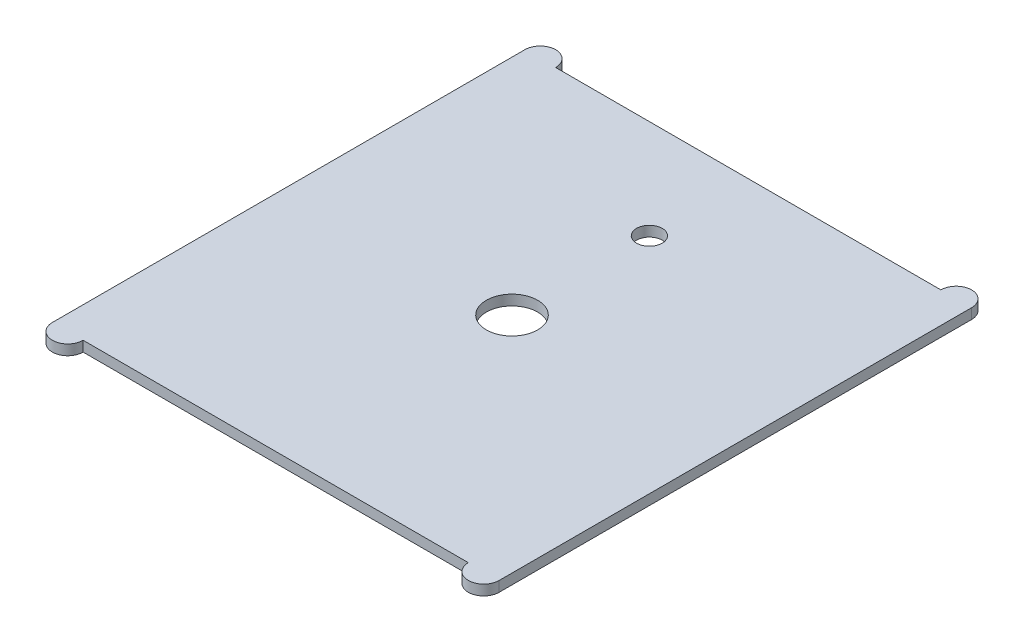
ISO-10303-21;
HEADER;
FILE_DESCRIPTION(('STEP AP214'),'2;1');
FILE_NAME('part.step','',(''),(''),'','','');
FILE_SCHEMA(('AUTOMOTIVE_DESIGN { 1 0 10303 214 1 1 1 1 }'));
ENDSEC;
DATA;
#1=APPLICATION_CONTEXT('core data for automotive mechanical design processes');
#2=APPLICATION_PROTOCOL_DEFINITION('international standard','automotive_design',2000,#1);
#3=PRODUCT_CONTEXT('',#1,'mechanical');
#4=PRODUCT('Part','Part','',(#3));
#5=PRODUCT_RELATED_PRODUCT_CATEGORY('part','',(#4));
#6=PRODUCT_DEFINITION_FORMATION('','',#4);
#7=PRODUCT_DEFINITION_CONTEXT('part definition',#1,'design');
#8=PRODUCT_DEFINITION('design','',#6,#7);
#9=PRODUCT_DEFINITION_SHAPE('','',#8);
#10=(LENGTH_UNIT() NAMED_UNIT(*) SI_UNIT(.MILLI.,.METRE.));
#11=(NAMED_UNIT(*) PLANE_ANGLE_UNIT() SI_UNIT($,.RADIAN.));
#12=(NAMED_UNIT(*) SI_UNIT($,.STERADIAN.) SOLID_ANGLE_UNIT());
#13=UNCERTAINTY_MEASURE_WITH_UNIT(LENGTH_MEASURE(1.E-05),#10,'distance_accuracy_value','');
#14=(GEOMETRIC_REPRESENTATION_CONTEXT(3) GLOBAL_UNCERTAINTY_ASSIGNED_CONTEXT((#13)) GLOBAL_UNIT_ASSIGNED_CONTEXT((#10,
#11,#12)) REPRESENTATION_CONTEXT('',''));
#15=CARTESIAN_POINT('',(0.,0.,0.));
#16=DIRECTION('',(0.,0.,1.));
#17=DIRECTION('',(1.,0.,0.));
#18=AXIS2_PLACEMENT_3D('',#15,#16,#17);
#19=CARTESIAN_POINT('',(202.5,-10.,230.));
#20=DIRECTION('',(0.,1.,0.));
#21=DIRECTION('',(0.,0.,1.));
#22=AXIS2_PLACEMENT_3D('',#19,#20,#21);
#23=CYLINDRICAL_SURFACE('',#22,15.);
#24=CARTESIAN_POINT('',(202.5,0.,230.));
#25=DIRECTION('',(0.,1.,0.));
#26=DIRECTION('',(0.,0.,-1.));
#27=AXIS2_PLACEMENT_3D('',#24,#25,#26);
#28=CIRCLE('',#27,15.);
#29=CARTESIAN_POINT('',(187.5,0.,230.));
#30=VERTEX_POINT('',#29);
#31=CARTESIAN_POINT('',(217.5,0.,230.));
#32=VERTEX_POINT('',#31);
#33=EDGE_CURVE('E142',#30,#32,#28,.T.);
#34=ORIENTED_EDGE('',*,*,#33,.F.);
#35=DIRECTION('',(0.,1.,0.));
#36=VECTOR('',#35,1.);
#37=CARTESIAN_POINT('',(187.5,-10.,230.));
#38=LINE('',#37,#36);
#39=CARTESIAN_POINT('',(187.5,-10.,230.));
#40=VERTEX_POINT('',#39);
#41=EDGE_CURVE('E11',#40,#30,#38,.T.);
#42=ORIENTED_EDGE('',*,*,#41,.F.);
#43=CARTESIAN_POINT('',(202.5,-10.,230.));
#44=DIRECTION('',(0.,1.,0.));
#45=DIRECTION('',(0.,0.,-1.));
#46=AXIS2_PLACEMENT_3D('',#43,#44,#45);
#47=CIRCLE('',#46,15.);
#48=CARTESIAN_POINT('',(217.5,-10.,230.));
#49=VERTEX_POINT('',#48);
#50=EDGE_CURVE('E171',#40,#49,#47,.T.);
#51=ORIENTED_EDGE('',*,*,#50,.T.);
#52=DIRECTION('',(0.,1.,0.));
#53=VECTOR('',#52,1.);
#54=CARTESIAN_POINT('',(217.5,-10.,230.));
#55=LINE('',#54,#53);
#56=EDGE_CURVE('E42',#49,#32,#55,.T.);
#57=ORIENTED_EDGE('',*,*,#56,.T.);
#58=EDGE_LOOP('',(#34,#42,#51,#57));
#59=FACE_BOUND('',#58,.T.);
#60=ADVANCED_FACE('F39',(#59),#23,.T.);
#61=CARTESIAN_POINT('',(-187.5,-10.,230.));
#62=DIRECTION('',(0.,0.,1.));
#63=DIRECTION('',(1.,0.,0.));
#64=AXIS2_PLACEMENT_3D('',#61,#62,#63);
#65=PLANE('',#64);
#66=DIRECTION('',(1.,0.,0.));
#67=VECTOR('',#66,1.);
#68=CARTESIAN_POINT('',(-187.5,0.,230.));
#69=LINE('',#68,#67);
#70=CARTESIAN_POINT('',(-187.5,0.,230.));
#71=VERTEX_POINT('',#70);
#72=EDGE_CURVE('E168',#71,#30,#69,.T.);
#73=ORIENTED_EDGE('',*,*,#72,.F.);
#74=DIRECTION('',(0.,1.,0.));
#75=VECTOR('',#74,1.);
#76=CARTESIAN_POINT('',(-187.5,-10.,230.));
#77=LINE('',#76,#75);
#78=CARTESIAN_POINT('',(-187.5,-10.,230.));
#79=VERTEX_POINT('',#78);
#80=EDGE_CURVE('E49',#79,#71,#77,.T.);
#81=ORIENTED_EDGE('',*,*,#80,.F.);
#82=DIRECTION('',(1.,0.,0.));
#83=VECTOR('',#82,1.);
#84=CARTESIAN_POINT('',(-187.5,-10.,230.));
#85=LINE('',#84,#83);
#86=EDGE_CURVE('E128',#79,#40,#85,.T.);
#87=ORIENTED_EDGE('',*,*,#86,.T.);
#88=ORIENTED_EDGE('',*,*,#41,.T.);
#89=EDGE_LOOP('',(#73,#81,#87,#88));
#90=FACE_BOUND('',#89,.T.);
#91=ADVANCED_FACE('F189',(#90),#65,.T.);
#92=CARTESIAN_POINT('',(-202.5,-10.,230.));
#93=DIRECTION('',(0.,1.,0.));
#94=DIRECTION('',(0.,0.,1.));
#95=AXIS2_PLACEMENT_3D('',#92,#93,#94);
#96=CYLINDRICAL_SURFACE('',#95,15.);
#97=CARTESIAN_POINT('',(-202.5,0.,230.));
#98=DIRECTION('',(0.,1.,0.));
#99=DIRECTION('',(0.,0.,1.));
#100=AXIS2_PLACEMENT_3D('',#97,#98,#99);
#101=CIRCLE('',#100,15.);
#102=CARTESIAN_POINT('',(-217.5,0.,230.));
#103=VERTEX_POINT('',#102);
#104=EDGE_CURVE('E114',#103,#71,#101,.T.);
#105=ORIENTED_EDGE('',*,*,#104,.F.);
#106=DIRECTION('',(0.,1.,0.));
#107=VECTOR('',#106,1.);
#108=CARTESIAN_POINT('',(-217.5,-10.,230.));
#109=LINE('',#108,#107);
#110=CARTESIAN_POINT('',(-217.5,-10.,230.));
#111=VERTEX_POINT('',#110);
#112=EDGE_CURVE('E109',#111,#103,#109,.T.);
#113=ORIENTED_EDGE('',*,*,#112,.F.);
#114=CARTESIAN_POINT('',(-202.5,-10.,230.));
#115=DIRECTION('',(0.,1.,0.));
#116=DIRECTION('',(0.,0.,1.));
#117=AXIS2_PLACEMENT_3D('',#114,#115,#116);
#118=CIRCLE('',#117,15.);
#119=EDGE_CURVE('E112',#111,#79,#118,.T.);
#120=ORIENTED_EDGE('',*,*,#119,.T.);
#121=ORIENTED_EDGE('',*,*,#80,.T.);
#122=EDGE_LOOP('',(#105,#113,#120,#121));
#123=FACE_BOUND('',#122,.T.);
#124=ADVANCED_FACE('F111',(#123),#96,.T.);
#125=CARTESIAN_POINT('',(-217.5,-10.,-230.));
#126=DIRECTION('',(-1.,0.,0.));
#127=DIRECTION('',(0.,0.,1.));
#128=AXIS2_PLACEMENT_3D('',#125,#126,#127);
#129=PLANE('',#128);
#130=DIRECTION('',(0.,0.,1.));
#131=VECTOR('',#130,1.);
#132=CARTESIAN_POINT('',(-217.5,0.,-230.));
#133=LINE('',#132,#131);
#134=CARTESIAN_POINT('',(-217.5,0.,-230.));
#135=VERTEX_POINT('',#134);
#136=EDGE_CURVE('E163',#135,#103,#133,.T.);
#137=ORIENTED_EDGE('',*,*,#136,.F.);
#138=DIRECTION('',(0.,1.,0.));
#139=VECTOR('',#138,1.);
#140=CARTESIAN_POINT('',(-217.5,-10.,-230.));
#141=LINE('',#140,#139);
#142=CARTESIAN_POINT('',(-217.5,-10.,-230.));
#143=VERTEX_POINT('',#142);
#144=EDGE_CURVE('E120',#143,#135,#141,.T.);
#145=ORIENTED_EDGE('',*,*,#144,.F.);
#146=DIRECTION('',(0.,0.,1.));
#147=VECTOR('',#146,1.);
#148=CARTESIAN_POINT('',(-217.5,-10.,-230.));
#149=LINE('',#148,#147);
#150=EDGE_CURVE('E126',#143,#111,#149,.T.);
#151=ORIENTED_EDGE('',*,*,#150,.T.);
#152=ORIENTED_EDGE('',*,*,#112,.T.);
#153=EDGE_LOOP('',(#137,#145,#151,#152));
#154=FACE_BOUND('',#153,.T.);
#155=ADVANCED_FACE('F131',(#154),#129,.T.);
#156=CARTESIAN_POINT('',(-202.5,-10.,-230.));
#157=DIRECTION('',(0.,1.,0.));
#158=DIRECTION('',(0.,0.,1.));
#159=AXIS2_PLACEMENT_3D('',#156,#157,#158);
#160=CYLINDRICAL_SURFACE('',#159,15.0000000000001);
#161=CARTESIAN_POINT('',(-202.5,0.,-230.));
#162=DIRECTION('',(0.,1.,0.));
#163=DIRECTION('',(0.,0.,-1.));
#164=AXIS2_PLACEMENT_3D('',#161,#162,#163);
#165=CIRCLE('',#164,15.0000000000001);
#166=CARTESIAN_POINT('',(-187.5,0.,-230.));
#167=VERTEX_POINT('',#166);
#168=EDGE_CURVE('E159',#167,#135,#165,.T.);
#169=ORIENTED_EDGE('',*,*,#168,.F.);
#170=DIRECTION('',(0.,1.,0.));
#171=VECTOR('',#170,1.);
#172=CARTESIAN_POINT('',(-187.5,-10.,-230.));
#173=LINE('',#172,#171);
#174=CARTESIAN_POINT('',(-187.5,-10.,-230.));
#175=VERTEX_POINT('',#174);
#176=EDGE_CURVE('E177',#175,#167,#173,.T.);
#177=ORIENTED_EDGE('',*,*,#176,.F.);
#178=CARTESIAN_POINT('',(-202.5,-10.,-230.));
#179=DIRECTION('',(0.,1.,0.));
#180=DIRECTION('',(0.,0.,-1.));
#181=AXIS2_PLACEMENT_3D('',#178,#179,#180);
#182=CIRCLE('',#181,15.0000000000001);
#183=EDGE_CURVE('E133',#175,#143,#182,.T.);
#184=ORIENTED_EDGE('',*,*,#183,.T.);
#185=ORIENTED_EDGE('',*,*,#144,.T.);
#186=EDGE_LOOP('',(#169,#177,#184,#185));
#187=FACE_BOUND('',#186,.T.);
#188=ADVANCED_FACE('F202',(#187),#160,.T.);
#189=CARTESIAN_POINT('',(-187.5,-10.,-230.));
#190=DIRECTION('',(0.,0.,-1.));
#191=DIRECTION('',(-1.,0.,0.));
#192=AXIS2_PLACEMENT_3D('',#189,#190,#191);
#193=PLANE('',#192);
#194=DIRECTION('',(-1.,0.,0.));
#195=VECTOR('',#194,1.);
#196=CARTESIAN_POINT('',(-187.5,0.,-230.));
#197=LINE('',#196,#195);
#198=CARTESIAN_POINT('',(187.5,0.,-230.));
#199=VERTEX_POINT('',#198);
#200=EDGE_CURVE('E155',#199,#167,#197,.T.);
#201=ORIENTED_EDGE('',*,*,#200,.F.);
#202=DIRECTION('',(0.,1.,0.));
#203=VECTOR('',#202,1.);
#204=CARTESIAN_POINT('',(187.5,-10.,-230.));
#205=LINE('',#204,#203);
#206=CARTESIAN_POINT('',(187.5,-10.,-230.));
#207=VERTEX_POINT('',#206);
#208=EDGE_CURVE('E180',#207,#199,#205,.T.);
#209=ORIENTED_EDGE('',*,*,#208,.F.);
#210=DIRECTION('',(-1.,0.,0.));
#211=VECTOR('',#210,1.);
#212=CARTESIAN_POINT('',(-187.5,-10.,-230.));
#213=LINE('',#212,#211);
#214=EDGE_CURVE('E136',#207,#175,#213,.T.);
#215=ORIENTED_EDGE('',*,*,#214,.T.);
#216=ORIENTED_EDGE('',*,*,#176,.T.);
#217=EDGE_LOOP('',(#201,#209,#215,#216));
#218=FACE_BOUND('',#217,.T.);
#219=ADVANCED_FACE('F205',(#218),#193,.T.);
#220=CARTESIAN_POINT('',(202.5,-10.,-230.));
#221=DIRECTION('',(0.,1.,0.));
#222=DIRECTION('',(0.,0.,1.));
#223=AXIS2_PLACEMENT_3D('',#220,#221,#222);
#224=CYLINDRICAL_SURFACE('',#223,15.);
#225=CARTESIAN_POINT('',(202.5,0.,-230.));
#226=DIRECTION('',(0.,1.,0.));
#227=DIRECTION('',(0.,0.,1.));
#228=AXIS2_PLACEMENT_3D('',#225,#226,#227);
#229=CIRCLE('',#228,15.);
#230=CARTESIAN_POINT('',(217.5,0.,-230.));
#231=VERTEX_POINT('',#230);
#232=EDGE_CURVE('E151',#231,#199,#229,.T.);
#233=ORIENTED_EDGE('',*,*,#232,.F.);
#234=DIRECTION('',(0.,1.,0.));
#235=VECTOR('',#234,1.);
#236=CARTESIAN_POINT('',(217.5,-10.,-230.));
#237=LINE('',#236,#235);
#238=CARTESIAN_POINT('',(217.5,-10.,-230.));
#239=VERTEX_POINT('',#238);
#240=EDGE_CURVE('E182',#239,#231,#237,.T.);
#241=ORIENTED_EDGE('',*,*,#240,.F.);
#242=CARTESIAN_POINT('',(202.5,-10.,-230.));
#243=DIRECTION('',(0.,1.,0.));
#244=DIRECTION('',(0.,0.,1.));
#245=AXIS2_PLACEMENT_3D('',#242,#243,#244);
#246=CIRCLE('',#245,15.);
#247=EDGE_CURVE('E257',#239,#207,#246,.T.);
#248=ORIENTED_EDGE('',*,*,#247,.T.);
#249=ORIENTED_EDGE('',*,*,#208,.T.);
#250=EDGE_LOOP('',(#233,#241,#248,#249));
#251=FACE_BOUND('',#250,.T.);
#252=ADVANCED_FACE('F209',(#251),#224,.T.);
#253=CARTESIAN_POINT('',(217.5,-10.,-230.));
#254=DIRECTION('',(1.,0.,0.));
#255=DIRECTION('',(0.,0.,-1.));
#256=AXIS2_PLACEMENT_3D('',#253,#254,#255);
#257=PLANE('',#256);
#258=DIRECTION('',(0.,0.,-1.));
#259=VECTOR('',#258,1.);
#260=CARTESIAN_POINT('',(217.5,0.,-230.));
#261=LINE('',#260,#259);
#262=EDGE_CURVE('E146',#32,#231,#261,.T.);
#263=ORIENTED_EDGE('',*,*,#262,.F.);
#264=ORIENTED_EDGE('',*,*,#56,.F.);
#265=DIRECTION('',(0.,0.,-1.));
#266=VECTOR('',#265,1.);
#267=CARTESIAN_POINT('',(217.5,-10.,-230.));
#268=LINE('',#267,#266);
#269=EDGE_CURVE('E254',#49,#239,#268,.T.);
#270=ORIENTED_EDGE('',*,*,#269,.T.);
#271=ORIENTED_EDGE('',*,*,#240,.T.);
#272=EDGE_LOOP('',(#263,#264,#270,#271));
#273=FACE_BOUND('',#272,.T.);
#274=ADVANCED_FACE('F186',(#273),#257,.T.);
#275=CARTESIAN_POINT('',(202.5,-10.,230.));
#276=DIRECTION('',(0.,-1.,0.));
#277=DIRECTION('',(0.,0.,-1.));
#278=AXIS2_PLACEMENT_3D('',#275,#276,#277);
#279=PLANE('',#278);
#280=CARTESIAN_POINT('',(0.,-10.,-133.75));
#281=DIRECTION('',(0.,1.,0.));
#282=DIRECTION('',(0.,0.,1.));
#283=AXIS2_PLACEMENT_3D('',#280,#281,#282);
#284=CIRCLE('',#283,12.5);
#285=CARTESIAN_POINT('',(0.,-10.,-121.25));
#286=VERTEX_POINT('',#285);
#287=EDGE_CURVE('E236',#286,#286,#284,.T.);
#288=ORIENTED_EDGE('',*,*,#287,.T.);
#289=EDGE_LOOP('',(#288));
#290=FACE_BOUND('',#289,.T.);
#291=CARTESIAN_POINT('',(0.,-10.,0.));
#292=DIRECTION('',(0.,1.,0.));
#293=DIRECTION('',(0.,0.,1.));
#294=AXIS2_PLACEMENT_3D('',#291,#292,#293);
#295=CIRCLE('',#294,25.);
#296=CARTESIAN_POINT('',(0.,-10.,25.0000000000001));
#297=VERTEX_POINT('',#296);
#298=EDGE_CURVE('E147',#297,#297,#295,.T.);
#299=ORIENTED_EDGE('',*,*,#298,.T.);
#300=EDGE_LOOP('',(#299));
#301=FACE_BOUND('',#300,.T.);
#302=ORIENTED_EDGE('',*,*,#50,.F.);
#303=ORIENTED_EDGE('',*,*,#86,.F.);
#304=ORIENTED_EDGE('',*,*,#119,.F.);
#305=ORIENTED_EDGE('',*,*,#150,.F.);
#306=ORIENTED_EDGE('',*,*,#183,.F.);
#307=ORIENTED_EDGE('',*,*,#214,.F.);
#308=ORIENTED_EDGE('',*,*,#247,.F.);
#309=ORIENTED_EDGE('',*,*,#269,.F.);
#310=EDGE_LOOP('',(#302,#303,#304,#305,#306,#307,#308,#309));
#311=FACE_BOUND('',#310,.T.);
#312=ADVANCED_FACE('F124',(#290,#301,#311),#279,.T.);
#313=CARTESIAN_POINT('',(202.5,0.,230.));
#314=DIRECTION('',(0.,-1.,0.));
#315=DIRECTION('',(0.,0.,-1.));
#316=AXIS2_PLACEMENT_3D('',#313,#314,#315);
#317=PLANE('',#316);
#318=CARTESIAN_POINT('',(0.,0.,-133.75));
#319=DIRECTION('',(0.,1.,0.));
#320=DIRECTION('',(0.,0.,1.));
#321=AXIS2_PLACEMENT_3D('',#318,#319,#320);
#322=CIRCLE('',#321,12.5);
#323=CARTESIAN_POINT('',(0.,0.,-121.25));
#324=VERTEX_POINT('',#323);
#325=EDGE_CURVE('E239',#324,#324,#322,.T.);
#326=ORIENTED_EDGE('',*,*,#325,.F.);
#327=EDGE_LOOP('',(#326));
#328=FACE_BOUND('',#327,.T.);
#329=CARTESIAN_POINT('',(0.,0.,0.));
#330=DIRECTION('',(0.,1.,0.));
#331=DIRECTION('',(0.,0.,1.));
#332=AXIS2_PLACEMENT_3D('',#329,#330,#331);
#333=CIRCLE('',#332,25.);
#334=CARTESIAN_POINT('',(0.,0.,25.0000000000001));
#335=VERTEX_POINT('',#334);
#336=EDGE_CURVE('E243',#335,#335,#333,.T.);
#337=ORIENTED_EDGE('',*,*,#336,.F.);
#338=EDGE_LOOP('',(#337));
#339=FACE_BOUND('',#338,.T.);
#340=ORIENTED_EDGE('',*,*,#33,.T.);
#341=ORIENTED_EDGE('',*,*,#262,.T.);
#342=ORIENTED_EDGE('',*,*,#232,.T.);
#343=ORIENTED_EDGE('',*,*,#200,.T.);
#344=ORIENTED_EDGE('',*,*,#168,.T.);
#345=ORIENTED_EDGE('',*,*,#136,.T.);
#346=ORIENTED_EDGE('',*,*,#104,.T.);
#347=ORIENTED_EDGE('',*,*,#72,.T.);
#348=EDGE_LOOP('',(#340,#341,#342,#343,#344,#345,#346,#347));
#349=FACE_BOUND('',#348,.T.);
#350=ADVANCED_FACE('F188',(#328,#339,#349),#317,.F.);
#351=CARTESIAN_POINT('',(0.,-10.,0.));
#352=DIRECTION('',(0.,1.,0.));
#353=DIRECTION('',(0.,0.,1.));
#354=AXIS2_PLACEMENT_3D('',#351,#352,#353);
#355=CYLINDRICAL_SURFACE('',#354,25.);
#356=ORIENTED_EDGE('',*,*,#298,.F.);
#357=EDGE_LOOP('',(#356));
#358=FACE_BOUND('',#357,.T.);
#359=ORIENTED_EDGE('',*,*,#336,.T.);
#360=EDGE_LOOP('',(#359));
#361=FACE_BOUND('',#360,.T.);
#362=ADVANCED_FACE('F221',(#358,#361),#355,.F.);
#363=CARTESIAN_POINT('',(0.,-10.,-133.75));
#364=DIRECTION('',(0.,1.,0.));
#365=DIRECTION('',(0.,0.,1.));
#366=AXIS2_PLACEMENT_3D('',#363,#364,#365);
#367=CYLINDRICAL_SURFACE('',#366,12.5);
#368=ORIENTED_EDGE('',*,*,#287,.F.);
#369=EDGE_LOOP('',(#368));
#370=FACE_BOUND('',#369,.T.);
#371=ORIENTED_EDGE('',*,*,#325,.T.);
#372=EDGE_LOOP('',(#371));
#373=FACE_BOUND('',#372,.T.);
#374=ADVANCED_FACE('F228',(#370,#373),#367,.F.);
#375=CLOSED_SHELL('',(#60,#91,#124,#155,#188,#219,#252,#274,#312,#350,#362,#374));
#376=MANIFOLD_SOLID_BREP('B2',#375);
#377=ADVANCED_BREP_SHAPE_REPRESENTATION('',(#18,#376),#14);
#378=SHAPE_DEFINITION_REPRESENTATION(#9,#377);
ENDSEC;
END-ISO-10303-21;
